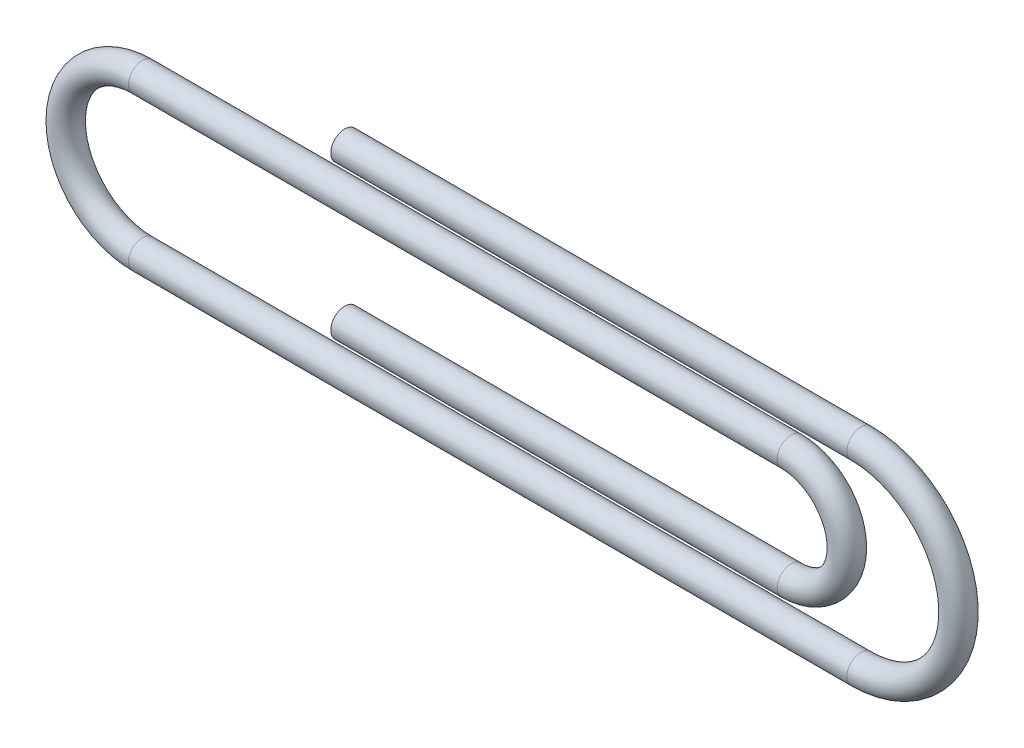
ISO-10303-21;
HEADER;
FILE_DESCRIPTION(('STEP AP214'),'2;1');
FILE_NAME('part.step','',(''),(''),'','','');
FILE_SCHEMA(('AUTOMOTIVE_DESIGN { 1 0 10303 214 1 1 1 1 }'));
ENDSEC;
DATA;
#1=APPLICATION_CONTEXT('core data for automotive mechanical design processes');
#2=APPLICATION_PROTOCOL_DEFINITION('international standard','automotive_design',2000,#1);
#3=PRODUCT_CONTEXT('',#1,'mechanical');
#4=PRODUCT('Part','Part','',(#3));
#5=PRODUCT_RELATED_PRODUCT_CATEGORY('part','',(#4));
#6=PRODUCT_DEFINITION_FORMATION('','',#4);
#7=PRODUCT_DEFINITION_CONTEXT('part definition',#1,'design');
#8=PRODUCT_DEFINITION('design','',#6,#7);
#9=PRODUCT_DEFINITION_SHAPE('','',#8);
#10=(LENGTH_UNIT() NAMED_UNIT(*) SI_UNIT(.MILLI.,.METRE.));
#11=(NAMED_UNIT(*) PLANE_ANGLE_UNIT() SI_UNIT($,.RADIAN.));
#12=(NAMED_UNIT(*) SI_UNIT($,.STERADIAN.) SOLID_ANGLE_UNIT());
#13=UNCERTAINTY_MEASURE_WITH_UNIT(LENGTH_MEASURE(1.E-05),#10,'distance_accuracy_value','');
#14=(GEOMETRIC_REPRESENTATION_CONTEXT(3) GLOBAL_UNCERTAINTY_ASSIGNED_CONTEXT((#13)) GLOBAL_UNIT_ASSIGNED_CONTEXT((#10,
#11,#12)) REPRESENTATION_CONTEXT('',''));
#15=CARTESIAN_POINT('',(0.,0.,0.));
#16=DIRECTION('',(0.,0.,1.));
#17=DIRECTION('',(1.,0.,0.));
#18=AXIS2_PLACEMENT_3D('',#15,#16,#17);
#19=CARTESIAN_POINT('',(0.,0.,0.));
#20=DIRECTION('',(1.,0.,0.));
#21=DIRECTION('',(0.,0.,-1.));
#22=AXIS2_PLACEMENT_3D('',#19,#20,#21);
#23=PLANE('',#22);
#24=CARTESIAN_POINT('',(0.,0.,0.));
#25=DIRECTION('',(1.,0.,0.));
#26=DIRECTION('',(0.,0.,-1.));
#27=AXIS2_PLACEMENT_3D('',#24,#25,#26);
#28=CIRCLE('',#27,0.5);
#29=CARTESIAN_POINT('',(0.,0.,-0.5));
#30=VERTEX_POINT('',#29);
#31=EDGE_CURVE('E72',#30,#30,#28,.T.);
#32=ORIENTED_EDGE('',*,*,#31,.F.);
#33=EDGE_LOOP('',(#32));
#34=FACE_BOUND('',#33,.T.);
#35=ADVANCED_FACE('F37',(#34),#23,.F.);
#36=CARTESIAN_POINT('',(0.,-5.50000000000001,0.));
#37=DIRECTION('',(-1.,0.,0.));
#38=DIRECTION('',(0.,0.,-1.));
#39=AXIS2_PLACEMENT_3D('',#36,#37,#38);
#40=PLANE('',#39);
#41=CARTESIAN_POINT('',(0.,-5.50000000000001,0.));
#42=DIRECTION('',(-1.,0.,0.));
#43=DIRECTION('',(0.,0.,-1.));
#44=AXIS2_PLACEMENT_3D('',#41,#42,#43);
#45=CIRCLE('',#44,0.5);
#46=CARTESIAN_POINT('',(0.,-5.50000000000001,-0.5));
#47=VERTEX_POINT('',#46);
#48=EDGE_CURVE('E10',#47,#47,#45,.T.);
#49=ORIENTED_EDGE('',*,*,#48,.T.);
#50=EDGE_LOOP('',(#49));
#51=FACE_BOUND('',#50,.T.);
#52=ADVANCED_FACE('F80',(#51),#40,.T.);
#53=CARTESIAN_POINT('',(0.,0.,0.));
#54=DIRECTION('',(1.,0.,0.));
#55=DIRECTION('',(0.,0.,-1.));
#56=AXIS2_PLACEMENT_3D('',#53,#54,#55);
#57=CYLINDRICAL_SURFACE('',#56,0.5);
#58=CARTESIAN_POINT('',(18.5,0.,0.));
#59=DIRECTION('',(1.,0.,0.));
#60=DIRECTION('',(0.,0.,-1.));
#61=AXIS2_PLACEMENT_3D('',#58,#59,#60);
#62=CIRCLE('',#61,0.5);
#63=CARTESIAN_POINT('',(18.5,0.5,0.));
#64=VERTEX_POINT('',#63);
#65=EDGE_CURVE('E68',#64,#64,#62,.T.);
#66=ORIENTED_EDGE('',*,*,#65,.F.);
#67=EDGE_LOOP('',(#66));
#68=FACE_BOUND('',#67,.T.);
#69=ORIENTED_EDGE('',*,*,#31,.T.);
#70=EDGE_LOOP('',(#69));
#71=FACE_BOUND('',#70,.T.);
#72=ADVANCED_FACE('F77',(#68,#71),#57,.T.);
#73=CARTESIAN_POINT('',(18.5,-3.5,0.));
#74=DIRECTION('',(0.,0.,-1.));
#75=DIRECTION('',(-1.,0.,0.));
#76=AXIS2_PLACEMENT_3D('',#73,#74,#75);
#77=TOROIDAL_SURFACE('',#76,3.5,0.5);
#78=CARTESIAN_POINT('',(18.5,-7.00000000000001,0.));
#79=DIRECTION('',(-1.,0.,0.));
#80=DIRECTION('',(0.,0.,-1.));
#81=AXIS2_PLACEMENT_3D('',#78,#79,#80);
#82=CIRCLE('',#81,0.5);
#83=CARTESIAN_POINT('',(18.5,-7.50000000000001,0.));
#84=VERTEX_POINT('',#83);
#85=EDGE_CURVE('E64',#84,#84,#82,.T.);
#86=CARTESIAN_POINT('',(18.5,-3.5,0.));
#87=DIRECTION('',(0.,0.,-1.));
#88=DIRECTION('',(-1.,0.,0.));
#89=AXIS2_PLACEMENT_3D('',#86,#87,#88);
#90=CIRCLE('',#89,4.);
#91=EDGE_CURVE('',#64,#84,#90,.T.);
#92=ORIENTED_EDGE('',*,*,#65,.T.);
#93=ORIENTED_EDGE('',*,*,#85,.F.);
#94=ORIENTED_EDGE('',*,*,#91,.T.);
#95=ORIENTED_EDGE('',*,*,#91,.F.);
#96=EDGE_LOOP('',(#92,#94,#93,#95));
#97=FACE_BOUND('',#96,.T.);
#98=ADVANCED_FACE('F106',(#97),#77,.T.);
#99=CARTESIAN_POINT('',(18.5,-7.00000000000001,0.));
#100=DIRECTION('',(-1.,0.,0.));
#101=DIRECTION('',(0.,-1.,0.));
#102=AXIS2_PLACEMENT_3D('',#99,#100,#101);
#103=CYLINDRICAL_SURFACE('',#102,0.5);
#104=CARTESIAN_POINT('',(-7.25,-7.,0.));
#105=DIRECTION('',(-1.,0.,0.));
#106=DIRECTION('',(0.,0.,-1.));
#107=AXIS2_PLACEMENT_3D('',#104,#105,#106);
#108=CIRCLE('',#107,0.5);
#109=CARTESIAN_POINT('',(-7.25,-7.5,0.));
#110=VERTEX_POINT('',#109);
#111=EDGE_CURVE('E60',#110,#110,#108,.T.);
#112=ORIENTED_EDGE('',*,*,#111,.F.);
#113=EDGE_LOOP('',(#112));
#114=FACE_BOUND('',#113,.T.);
#115=ORIENTED_EDGE('',*,*,#85,.T.);
#116=EDGE_LOOP('',(#115));
#117=FACE_BOUND('',#116,.T.);
#118=ADVANCED_FACE('F102',(#114,#117),#103,.T.);
#119=CARTESIAN_POINT('',(-7.25,-4.25,0.));
#120=DIRECTION('',(0.,0.,-1.));
#121=DIRECTION('',(-1.,0.,0.));
#122=AXIS2_PLACEMENT_3D('',#119,#120,#121);
#123=TOROIDAL_SURFACE('',#122,2.75,0.5);
#124=CARTESIAN_POINT('',(-7.25,-1.5,0.));
#125=DIRECTION('',(1.,0.,0.));
#126=DIRECTION('',(0.,0.,-1.));
#127=AXIS2_PLACEMENT_3D('',#124,#125,#126);
#128=CIRCLE('',#127,0.5);
#129=CARTESIAN_POINT('',(-7.25,-0.999999999999999,0.));
#130=VERTEX_POINT('',#129);
#131=EDGE_CURVE('E54',#130,#130,#128,.T.);
#132=CARTESIAN_POINT('',(-7.25,-4.25,0.));
#133=DIRECTION('',(0.,0.,-1.));
#134=DIRECTION('',(-1.,0.,0.));
#135=AXIS2_PLACEMENT_3D('',#132,#133,#134);
#136=CIRCLE('',#135,3.25);
#137=EDGE_CURVE('',#110,#130,#136,.T.);
#138=ORIENTED_EDGE('',*,*,#111,.T.);
#139=ORIENTED_EDGE('',*,*,#131,.F.);
#140=ORIENTED_EDGE('',*,*,#137,.T.);
#141=ORIENTED_EDGE('',*,*,#137,.F.);
#142=EDGE_LOOP('',(#138,#140,#139,#141));
#143=FACE_BOUND('',#142,.T.);
#144=ADVANCED_FACE('F98',(#143),#123,.T.);
#145=CARTESIAN_POINT('',(-7.25,-1.5,0.));
#146=DIRECTION('',(1.,0.,0.));
#147=DIRECTION('',(0.,1.,0.));
#148=AXIS2_PLACEMENT_3D('',#145,#146,#147);
#149=CYLINDRICAL_SURFACE('',#148,0.5);
#150=CARTESIAN_POINT('',(16.,-1.5,0.));
#151=DIRECTION('',(1.,0.,0.));
#152=DIRECTION('',(0.,0.,-1.));
#153=AXIS2_PLACEMENT_3D('',#150,#151,#152);
#154=CIRCLE('',#153,0.5);
#155=CARTESIAN_POINT('',(16.,-1.,0.));
#156=VERTEX_POINT('',#155);
#157=EDGE_CURVE('E49',#156,#156,#154,.T.);
#158=ORIENTED_EDGE('',*,*,#157,.F.);
#159=EDGE_LOOP('',(#158));
#160=FACE_BOUND('',#159,.T.);
#161=ORIENTED_EDGE('',*,*,#131,.T.);
#162=EDGE_LOOP('',(#161));
#163=FACE_BOUND('',#162,.T.);
#164=ADVANCED_FACE('F92',(#160,#163),#149,.T.);
#165=CARTESIAN_POINT('',(16.,-3.5,0.));
#166=DIRECTION('',(0.,0.,-1.));
#167=DIRECTION('',(-1.,0.,0.));
#168=AXIS2_PLACEMENT_3D('',#165,#166,#167);
#169=TOROIDAL_SURFACE('',#168,2.,0.5);
#170=CARTESIAN_POINT('',(16.,-5.5,0.));
#171=DIRECTION('',(-1.,0.,0.));
#172=DIRECTION('',(0.,0.,-1.));
#173=AXIS2_PLACEMENT_3D('',#170,#171,#172);
#174=CIRCLE('',#173,0.5);
#175=CARTESIAN_POINT('',(16.,-6.,0.));
#176=VERTEX_POINT('',#175);
#177=EDGE_CURVE('E44',#176,#176,#174,.T.);
#178=CARTESIAN_POINT('',(16.,-3.5,0.));
#179=DIRECTION('',(0.,0.,-1.));
#180=DIRECTION('',(-1.,0.,0.));
#181=AXIS2_PLACEMENT_3D('',#178,#179,#180);
#182=CIRCLE('',#181,2.5);
#183=EDGE_CURVE('',#156,#176,#182,.T.);
#184=ORIENTED_EDGE('',*,*,#157,.T.);
#185=ORIENTED_EDGE('',*,*,#177,.F.);
#186=ORIENTED_EDGE('',*,*,#183,.T.);
#187=ORIENTED_EDGE('',*,*,#183,.F.);
#188=EDGE_LOOP('',(#184,#186,#185,#187));
#189=FACE_BOUND('',#188,.T.);
#190=ADVANCED_FACE('F86',(#189),#169,.T.);
#191=CARTESIAN_POINT('',(16.,-5.5,0.));
#192=DIRECTION('',(-1.,0.,0.));
#193=DIRECTION('',(0.,-1.,0.));
#194=AXIS2_PLACEMENT_3D('',#191,#192,#193);
#195=CYLINDRICAL_SURFACE('',#194,0.5);
#196=ORIENTED_EDGE('',*,*,#48,.F.);
#197=EDGE_LOOP('',(#196));
#198=FACE_BOUND('',#197,.T.);
#199=ORIENTED_EDGE('',*,*,#177,.T.);
#200=EDGE_LOOP('',(#199));
#201=FACE_BOUND('',#200,.T.);
#202=ADVANCED_FACE('F84',(#198,#201),#195,.T.);
#203=CLOSED_SHELL('',(#35,#52,#72,#98,#118,#144,#164,#190,#202));
#204=MANIFOLD_SOLID_BREP('B2',#203);
#205=ADVANCED_BREP_SHAPE_REPRESENTATION('',(#18,#204),#14);
#206=SHAPE_DEFINITION_REPRESENTATION(#9,#205);
ENDSEC;
END-ISO-10303-21;
